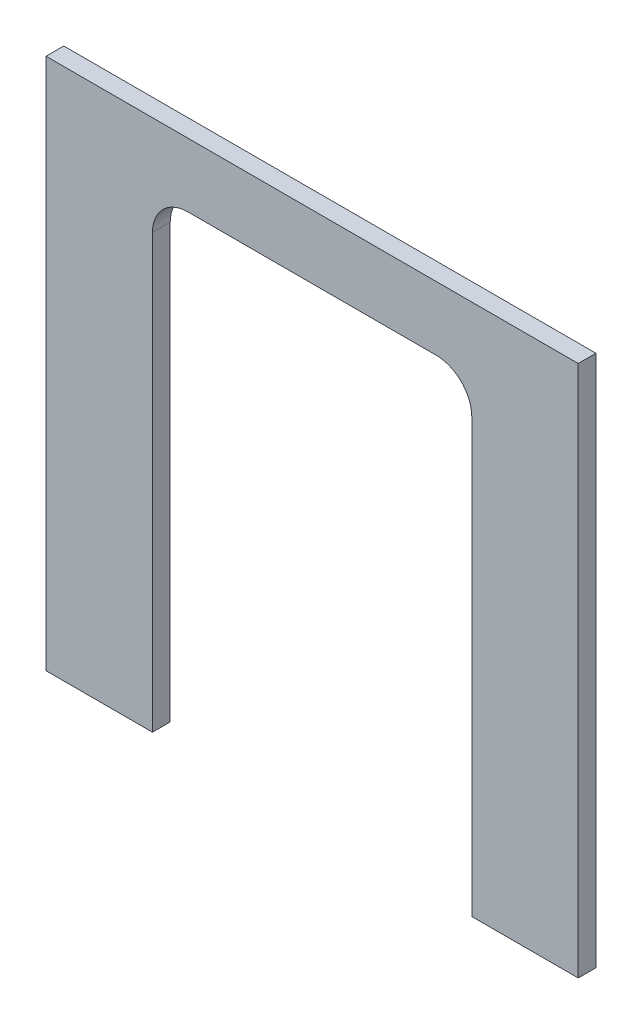
ISO-10303-21;
HEADER;
FILE_DESCRIPTION(('STEP AP214'),'2;1');
FILE_NAME('part.step','',(''),(''),'','','');
FILE_SCHEMA(('AUTOMOTIVE_DESIGN { 1 0 10303 214 1 1 1 1 }'));
ENDSEC;
DATA;
#1=APPLICATION_CONTEXT('core data for automotive mechanical design processes');
#2=APPLICATION_PROTOCOL_DEFINITION('international standard','automotive_design',2000,#1);
#3=PRODUCT_CONTEXT('',#1,'mechanical');
#4=PRODUCT('Part','Part','',(#3));
#5=PRODUCT_RELATED_PRODUCT_CATEGORY('part','',(#4));
#6=PRODUCT_DEFINITION_FORMATION('','',#4);
#7=PRODUCT_DEFINITION_CONTEXT('part definition',#1,'design');
#8=PRODUCT_DEFINITION('design','',#6,#7);
#9=PRODUCT_DEFINITION_SHAPE('','',#8);
#10=(LENGTH_UNIT() NAMED_UNIT(*) SI_UNIT(.MILLI.,.METRE.));
#11=(NAMED_UNIT(*) PLANE_ANGLE_UNIT() SI_UNIT($,.RADIAN.));
#12=(NAMED_UNIT(*) SI_UNIT($,.STERADIAN.) SOLID_ANGLE_UNIT());
#13=UNCERTAINTY_MEASURE_WITH_UNIT(LENGTH_MEASURE(1.E-05),#10,'distance_accuracy_value','');
#14=(GEOMETRIC_REPRESENTATION_CONTEXT(3) GLOBAL_UNCERTAINTY_ASSIGNED_CONTEXT((#13)) GLOBAL_UNIT_ASSIGNED_CONTEXT((#10,
#11,#12)) REPRESENTATION_CONTEXT('',''));
#15=CARTESIAN_POINT('',(0.,0.,0.));
#16=DIRECTION('',(0.,0.,1.));
#17=DIRECTION('',(1.,0.,0.));
#18=AXIS2_PLACEMENT_3D('',#15,#16,#17);
#19=CARTESIAN_POINT('',(45.,-75.,5.));
#20=DIRECTION('',(0.,1.,0.));
#21=DIRECTION('',(0.,0.,1.));
#22=AXIS2_PLACEMENT_3D('',#19,#20,#21);
#23=PLANE('',#22);
#24=DIRECTION('',(1.,0.,0.));
#25=VECTOR('',#24,1.);
#26=CARTESIAN_POINT('',(45.,-75.,0.));
#27=LINE('',#26,#25);
#28=CARTESIAN_POINT('',(45.,-75.,0.));
#29=VERTEX_POINT('',#28);
#30=CARTESIAN_POINT('',(75.,-75.,0.));
#31=VERTEX_POINT('',#30);
#32=EDGE_CURVE('E141',#29,#31,#27,.T.);
#33=ORIENTED_EDGE('',*,*,#32,.T.);
#34=DIRECTION('',(0.,0.,-1.));
#35=VECTOR('',#34,1.);
#36=CARTESIAN_POINT('',(75.,-75.,5.));
#37=LINE('',#36,#35);
#38=CARTESIAN_POINT('',(75.,-75.,5.));
#39=VERTEX_POINT('',#38);
#40=EDGE_CURVE('E11',#39,#31,#37,.T.);
#41=ORIENTED_EDGE('',*,*,#40,.F.);
#42=DIRECTION('',(1.,0.,0.));
#43=VECTOR('',#42,1.);
#44=CARTESIAN_POINT('',(45.,-75.,5.));
#45=LINE('',#44,#43);
#46=CARTESIAN_POINT('',(45.,-75.,5.));
#47=VERTEX_POINT('',#46);
#48=EDGE_CURVE('E159',#47,#39,#45,.T.);
#49=ORIENTED_EDGE('',*,*,#48,.F.);
#50=DIRECTION('',(0.,0.,-1.));
#51=VECTOR('',#50,1.);
#52=CARTESIAN_POINT('',(45.,-75.,5.));
#53=LINE('',#52,#51);
#54=EDGE_CURVE('E137',#47,#29,#53,.T.);
#55=ORIENTED_EDGE('',*,*,#54,.T.);
#56=EDGE_LOOP('',(#33,#41,#49,#55));
#57=FACE_BOUND('',#56,.T.);
#58=ADVANCED_FACE('F33',(#57),#23,.F.);
#59=CARTESIAN_POINT('',(75.,75.,5.));
#60=DIRECTION('',(-1.,0.,0.));
#61=DIRECTION('',(0.,-1.,0.));
#62=AXIS2_PLACEMENT_3D('',#59,#60,#61);
#63=PLANE('',#62);
#64=DIRECTION('',(0.,1.,0.));
#65=VECTOR('',#64,1.);
#66=CARTESIAN_POINT('',(75.,75.,0.));
#67=LINE('',#66,#65);
#68=CARTESIAN_POINT('',(75.,75.,0.));
#69=VERTEX_POINT('',#68);
#70=EDGE_CURVE('E144',#31,#69,#67,.T.);
#71=ORIENTED_EDGE('',*,*,#70,.T.);
#72=DIRECTION('',(0.,0.,-1.));
#73=VECTOR('',#72,1.);
#74=CARTESIAN_POINT('',(75.,75.,5.));
#75=LINE('',#74,#73);
#76=CARTESIAN_POINT('',(75.,75.,5.));
#77=VERTEX_POINT('',#76);
#78=EDGE_CURVE('E41',#77,#69,#75,.T.);
#79=ORIENTED_EDGE('',*,*,#78,.F.);
#80=DIRECTION('',(0.,1.,0.));
#81=VECTOR('',#80,1.);
#82=CARTESIAN_POINT('',(75.,75.,5.));
#83=LINE('',#82,#81);
#84=EDGE_CURVE('E98',#39,#77,#83,.T.);
#85=ORIENTED_EDGE('',*,*,#84,.F.);
#86=ORIENTED_EDGE('',*,*,#40,.T.);
#87=EDGE_LOOP('',(#71,#79,#85,#86));
#88=FACE_BOUND('',#87,.T.);
#89=ADVANCED_FACE('F208',(#88),#63,.F.);
#90=CARTESIAN_POINT('',(-75.,75.,5.));
#91=DIRECTION('',(0.,-1.,0.));
#92=DIRECTION('',(0.,0.,-1.));
#93=AXIS2_PLACEMENT_3D('',#90,#91,#92);
#94=PLANE('',#93);
#95=DIRECTION('',(-1.,0.,0.));
#96=VECTOR('',#95,1.);
#97=CARTESIAN_POINT('',(-75.,75.,0.));
#98=LINE('',#97,#96);
#99=CARTESIAN_POINT('',(-75.,75.,0.));
#100=VERTEX_POINT('',#99);
#101=EDGE_CURVE('E146',#69,#100,#98,.T.);
#102=ORIENTED_EDGE('',*,*,#101,.T.);
#103=DIRECTION('',(0.,0.,-1.));
#104=VECTOR('',#103,1.);
#105=CARTESIAN_POINT('',(-75.,75.,5.));
#106=LINE('',#105,#104);
#107=CARTESIAN_POINT('',(-75.,75.,5.));
#108=VERTEX_POINT('',#107);
#109=EDGE_CURVE('E172',#108,#100,#106,.T.);
#110=ORIENTED_EDGE('',*,*,#109,.F.);
#111=DIRECTION('',(-1.,0.,0.));
#112=VECTOR('',#111,1.);
#113=CARTESIAN_POINT('',(-75.,75.,5.));
#114=LINE('',#113,#112);
#115=EDGE_CURVE('E180',#77,#108,#114,.T.);
#116=ORIENTED_EDGE('',*,*,#115,.F.);
#117=ORIENTED_EDGE('',*,*,#78,.T.);
#118=EDGE_LOOP('',(#102,#110,#116,#117));
#119=FACE_BOUND('',#118,.T.);
#120=ADVANCED_FACE('F178',(#119),#94,.F.);
#121=CARTESIAN_POINT('',(-75.,75.,5.));
#122=DIRECTION('',(1.,0.,0.));
#123=DIRECTION('',(0.,1.,0.));
#124=AXIS2_PLACEMENT_3D('',#121,#122,#123);
#125=PLANE('',#124);
#126=DIRECTION('',(0.,-1.,0.));
#127=VECTOR('',#126,1.);
#128=CARTESIAN_POINT('',(-75.,75.,0.));
#129=LINE('',#128,#127);
#130=CARTESIAN_POINT('',(-75.,-75.,0.));
#131=VERTEX_POINT('',#130);
#132=EDGE_CURVE('E148',#100,#131,#129,.T.);
#133=ORIENTED_EDGE('',*,*,#132,.T.);
#134=DIRECTION('',(0.,0.,-1.));
#135=VECTOR('',#134,1.);
#136=CARTESIAN_POINT('',(-75.,-75.,5.));
#137=LINE('',#136,#135);
#138=CARTESIAN_POINT('',(-75.,-75.,5.));
#139=VERTEX_POINT('',#138);
#140=EDGE_CURVE('E169',#139,#131,#137,.T.);
#141=ORIENTED_EDGE('',*,*,#140,.F.);
#142=DIRECTION('',(0.,-1.,0.));
#143=VECTOR('',#142,1.);
#144=CARTESIAN_POINT('',(-75.,75.,5.));
#145=LINE('',#144,#143);
#146=EDGE_CURVE('E198',#108,#139,#145,.T.);
#147=ORIENTED_EDGE('',*,*,#146,.F.);
#148=ORIENTED_EDGE('',*,*,#109,.T.);
#149=EDGE_LOOP('',(#133,#141,#147,#148));
#150=FACE_BOUND('',#149,.T.);
#151=ADVANCED_FACE('F189',(#150),#125,.F.);
#152=CARTESIAN_POINT('',(-75.,-75.,5.));
#153=DIRECTION('',(0.,1.,0.));
#154=DIRECTION('',(0.,0.,1.));
#155=AXIS2_PLACEMENT_3D('',#152,#153,#154);
#156=PLANE('',#155);
#157=DIRECTION('',(1.,0.,0.));
#158=VECTOR('',#157,1.);
#159=CARTESIAN_POINT('',(-75.,-75.,0.));
#160=LINE('',#159,#158);
#161=CARTESIAN_POINT('',(-45.,-75.,0.));
#162=VERTEX_POINT('',#161);
#163=EDGE_CURVE('E150',#131,#162,#160,.T.);
#164=ORIENTED_EDGE('',*,*,#163,.T.);
#165=DIRECTION('',(0.,0.,-1.));
#166=VECTOR('',#165,1.);
#167=CARTESIAN_POINT('',(-45.,-75.,5.));
#168=LINE('',#167,#166);
#169=CARTESIAN_POINT('',(-45.,-75.,5.));
#170=VERTEX_POINT('',#169);
#171=EDGE_CURVE('E166',#170,#162,#168,.T.);
#172=ORIENTED_EDGE('',*,*,#171,.F.);
#173=DIRECTION('',(1.,0.,0.));
#174=VECTOR('',#173,1.);
#175=CARTESIAN_POINT('',(-75.,-75.,5.));
#176=LINE('',#175,#174);
#177=EDGE_CURVE('E195',#139,#170,#176,.T.);
#178=ORIENTED_EDGE('',*,*,#177,.F.);
#179=ORIENTED_EDGE('',*,*,#140,.T.);
#180=EDGE_LOOP('',(#164,#172,#178,#179));
#181=FACE_BOUND('',#180,.T.);
#182=ADVANCED_FACE('F193',(#181),#156,.F.);
#183=CARTESIAN_POINT('',(-45.,47.,5.));
#184=DIRECTION('',(-1.,0.,0.));
#185=DIRECTION('',(0.,-1.,0.));
#186=AXIS2_PLACEMENT_3D('',#183,#184,#185);
#187=PLANE('',#186);
#188=DIRECTION('',(0.,1.,0.));
#189=VECTOR('',#188,1.);
#190=CARTESIAN_POINT('',(-45.,47.,0.));
#191=LINE('',#190,#189);
#192=CARTESIAN_POINT('',(-45.,47.,0.));
#193=VERTEX_POINT('',#192);
#194=EDGE_CURVE('E152',#162,#193,#191,.T.);
#195=ORIENTED_EDGE('',*,*,#194,.T.);
#196=DIRECTION('',(0.,0.,-1.));
#197=VECTOR('',#196,1.);
#198=CARTESIAN_POINT('',(-45.,47.,5.));
#199=LINE('',#198,#197);
#200=CARTESIAN_POINT('',(-45.,47.,5.));
#201=VERTEX_POINT('',#200);
#202=EDGE_CURVE('E163',#201,#193,#199,.T.);
#203=ORIENTED_EDGE('',*,*,#202,.F.);
#204=DIRECTION('',(0.,1.,0.));
#205=VECTOR('',#204,1.);
#206=CARTESIAN_POINT('',(-45.,47.,5.));
#207=LINE('',#206,#205);
#208=EDGE_CURVE('E197',#170,#201,#207,.T.);
#209=ORIENTED_EDGE('',*,*,#208,.F.);
#210=ORIENTED_EDGE('',*,*,#171,.T.);
#211=EDGE_LOOP('',(#195,#203,#209,#210));
#212=FACE_BOUND('',#211,.T.);
#213=ADVANCED_FACE('F220',(#212),#187,.F.);
#214=CARTESIAN_POINT('',(-35.,47.,5.));
#215=DIRECTION('',(0.,0.,-1.));
#216=DIRECTION('',(-1.,0.,0.));
#217=AXIS2_PLACEMENT_3D('',#214,#215,#216);
#218=CYLINDRICAL_SURFACE('',#217,10.);
#219=CARTESIAN_POINT('',(-35.,47.,0.));
#220=DIRECTION('',(0.,0.,-1.));
#221=DIRECTION('',(1.,0.,0.));
#222=AXIS2_PLACEMENT_3D('',#219,#220,#221);
#223=CIRCLE('',#222,10.);
#224=CARTESIAN_POINT('',(-35.,57.,0.));
#225=VERTEX_POINT('',#224);
#226=EDGE_CURVE('E154',#193,#225,#223,.T.);
#227=ORIENTED_EDGE('',*,*,#226,.T.);
#228=DIRECTION('',(0.,0.,-1.));
#229=VECTOR('',#228,1.);
#230=CARTESIAN_POINT('',(-35.,57.,5.));
#231=LINE('',#230,#229);
#232=CARTESIAN_POINT('',(-35.,57.,5.));
#233=VERTEX_POINT('',#232);
#234=EDGE_CURVE('E132',#233,#225,#231,.T.);
#235=ORIENTED_EDGE('',*,*,#234,.F.);
#236=CARTESIAN_POINT('',(-35.,47.,5.));
#237=DIRECTION('',(0.,0.,-1.));
#238=DIRECTION('',(1.,0.,0.));
#239=AXIS2_PLACEMENT_3D('',#236,#237,#238);
#240=CIRCLE('',#239,10.);
#241=EDGE_CURVE('E123',#201,#233,#240,.T.);
#242=ORIENTED_EDGE('',*,*,#241,.F.);
#243=ORIENTED_EDGE('',*,*,#202,.T.);
#244=EDGE_LOOP('',(#227,#235,#242,#243));
#245=FACE_BOUND('',#244,.T.);
#246=ADVANCED_FACE('F223',(#245),#218,.F.);
#247=CARTESIAN_POINT('',(35.,57.,5.));
#248=DIRECTION('',(0.,1.,0.));
#249=DIRECTION('',(0.,0.,1.));
#250=AXIS2_PLACEMENT_3D('',#247,#248,#249);
#251=PLANE('',#250);
#252=DIRECTION('',(1.,0.,0.));
#253=VECTOR('',#252,1.);
#254=CARTESIAN_POINT('',(35.,57.,0.));
#255=LINE('',#254,#253);
#256=CARTESIAN_POINT('',(35.,57.,0.));
#257=VERTEX_POINT('',#256);
#258=EDGE_CURVE('E131',#225,#257,#255,.T.);
#259=ORIENTED_EDGE('',*,*,#258,.T.);
#260=DIRECTION('',(0.,0.,-1.));
#261=VECTOR('',#260,1.);
#262=CARTESIAN_POINT('',(35.,57.,5.));
#263=LINE('',#262,#261);
#264=CARTESIAN_POINT('',(35.,57.,5.));
#265=VERTEX_POINT('',#264);
#266=EDGE_CURVE('E128',#265,#257,#263,.T.);
#267=ORIENTED_EDGE('',*,*,#266,.F.);
#268=DIRECTION('',(1.,0.,0.));
#269=VECTOR('',#268,1.);
#270=CARTESIAN_POINT('',(35.,57.,5.));
#271=LINE('',#270,#269);
#272=EDGE_CURVE('E117',#233,#265,#271,.T.);
#273=ORIENTED_EDGE('',*,*,#272,.F.);
#274=ORIENTED_EDGE('',*,*,#234,.T.);
#275=EDGE_LOOP('',(#259,#267,#273,#274));
#276=FACE_BOUND('',#275,.T.);
#277=ADVANCED_FACE('F129',(#276),#251,.F.);
#278=CARTESIAN_POINT('',(35.,47.,5.));
#279=DIRECTION('',(0.,0.,-1.));
#280=DIRECTION('',(-1.,0.,0.));
#281=AXIS2_PLACEMENT_3D('',#278,#279,#280);
#282=CYLINDRICAL_SURFACE('',#281,10.);
#283=CARTESIAN_POINT('',(35.,47.,0.));
#284=DIRECTION('',(0.,0.,-1.));
#285=DIRECTION('',(1.,0.,0.));
#286=AXIS2_PLACEMENT_3D('',#283,#284,#285);
#287=CIRCLE('',#286,10.);
#288=CARTESIAN_POINT('',(45.,47.,0.));
#289=VERTEX_POINT('',#288);
#290=EDGE_CURVE('E84',#257,#289,#287,.T.);
#291=ORIENTED_EDGE('',*,*,#290,.T.);
#292=DIRECTION('',(0.,0.,-1.));
#293=VECTOR('',#292,1.);
#294=CARTESIAN_POINT('',(45.,47.,5.));
#295=LINE('',#294,#293);
#296=CARTESIAN_POINT('',(45.,47.,5.));
#297=VERTEX_POINT('',#296);
#298=EDGE_CURVE('E133',#297,#289,#295,.T.);
#299=ORIENTED_EDGE('',*,*,#298,.F.);
#300=CARTESIAN_POINT('',(35.,47.,5.));
#301=DIRECTION('',(0.,0.,-1.));
#302=DIRECTION('',(1.,0.,0.));
#303=AXIS2_PLACEMENT_3D('',#300,#301,#302);
#304=CIRCLE('',#303,10.);
#305=EDGE_CURVE('E121',#265,#297,#304,.T.);
#306=ORIENTED_EDGE('',*,*,#305,.F.);
#307=ORIENTED_EDGE('',*,*,#266,.T.);
#308=EDGE_LOOP('',(#291,#299,#306,#307));
#309=FACE_BOUND('',#308,.T.);
#310=ADVANCED_FACE('F135',(#309),#282,.F.);
#311=CARTESIAN_POINT('',(45.,-75.,5.));
#312=DIRECTION('',(1.,0.,0.));
#313=DIRECTION('',(0.,0.,-1.));
#314=AXIS2_PLACEMENT_3D('',#311,#312,#313);
#315=PLANE('',#314);
#316=DIRECTION('',(0.,-1.,0.));
#317=VECTOR('',#316,1.);
#318=CARTESIAN_POINT('',(45.,-75.,0.));
#319=LINE('',#318,#317);
#320=EDGE_CURVE('E90',#289,#29,#319,.T.);
#321=ORIENTED_EDGE('',*,*,#320,.T.);
#322=ORIENTED_EDGE('',*,*,#54,.F.);
#323=DIRECTION('',(0.,-1.,0.));
#324=VECTOR('',#323,1.);
#325=CARTESIAN_POINT('',(45.,-75.,5.));
#326=LINE('',#325,#324);
#327=EDGE_CURVE('E49',#297,#47,#326,.T.);
#328=ORIENTED_EDGE('',*,*,#327,.F.);
#329=ORIENTED_EDGE('',*,*,#298,.T.);
#330=EDGE_LOOP('',(#321,#322,#328,#329));
#331=FACE_BOUND('',#330,.T.);
#332=ADVANCED_FACE('F232',(#331),#315,.F.);
#333=CARTESIAN_POINT('',(-35.,47.,5.));
#334=DIRECTION('',(0.,0.,1.));
#335=DIRECTION('',(1.,0.,0.));
#336=AXIS2_PLACEMENT_3D('',#333,#334,#335);
#337=PLANE('',#336);
#338=ORIENTED_EDGE('',*,*,#48,.T.);
#339=ORIENTED_EDGE('',*,*,#84,.T.);
#340=ORIENTED_EDGE('',*,*,#115,.T.);
#341=ORIENTED_EDGE('',*,*,#146,.T.);
#342=ORIENTED_EDGE('',*,*,#177,.T.);
#343=ORIENTED_EDGE('',*,*,#208,.T.);
#344=ORIENTED_EDGE('',*,*,#241,.T.);
#345=ORIENTED_EDGE('',*,*,#272,.T.);
#346=ORIENTED_EDGE('',*,*,#305,.T.);
#347=ORIENTED_EDGE('',*,*,#327,.T.);
#348=EDGE_LOOP('',(#338,#339,#340,#341,#342,#343,#344,#345,#346,#347));
#349=FACE_BOUND('',#348,.T.);
#350=ADVANCED_FACE('F119',(#349),#337,.T.);
#351=CARTESIAN_POINT('',(-35.,47.,0.));
#352=DIRECTION('',(0.,0.,1.));
#353=DIRECTION('',(1.,0.,0.));
#354=AXIS2_PLACEMENT_3D('',#351,#352,#353);
#355=PLANE('',#354);
#356=ORIENTED_EDGE('',*,*,#32,.F.);
#357=ORIENTED_EDGE('',*,*,#320,.F.);
#358=ORIENTED_EDGE('',*,*,#290,.F.);
#359=ORIENTED_EDGE('',*,*,#258,.F.);
#360=ORIENTED_EDGE('',*,*,#226,.F.);
#361=ORIENTED_EDGE('',*,*,#194,.F.);
#362=ORIENTED_EDGE('',*,*,#163,.F.);
#363=ORIENTED_EDGE('',*,*,#132,.F.);
#364=ORIENTED_EDGE('',*,*,#101,.F.);
#365=ORIENTED_EDGE('',*,*,#70,.F.);
#366=EDGE_LOOP('',(#356,#357,#358,#359,#360,#361,#362,#363,#364,#365));
#367=FACE_BOUND('',#366,.T.);
#368=ADVANCED_FACE('F184',(#367),#355,.F.);
#369=CLOSED_SHELL('',(#58,#89,#120,#151,#182,#213,#246,#277,#310,#332,#350,#368));
#370=MANIFOLD_SOLID_BREP('B2',#369);
#371=ADVANCED_BREP_SHAPE_REPRESENTATION('',(#18,#370),#14);
#372=SHAPE_DEFINITION_REPRESENTATION(#9,#371);
ENDSEC;
END-ISO-10303-21;
